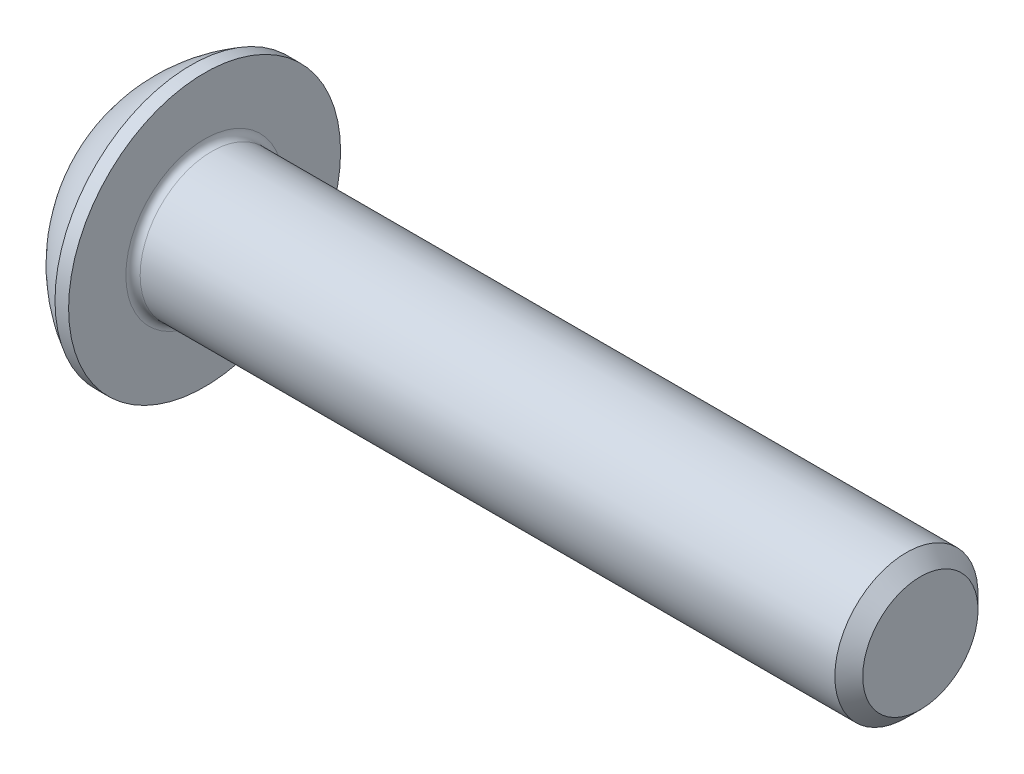
ISO-10303-21;
HEADER;
FILE_DESCRIPTION(('STEP AP214'),'2;1');
FILE_NAME('part.step','',(''),(''),'','','');
FILE_SCHEMA(('AUTOMOTIVE_DESIGN { 1 0 10303 214 1 1 1 1 }'));
ENDSEC;
DATA;
#1=APPLICATION_CONTEXT('core data for automotive mechanical design processes');
#2=APPLICATION_PROTOCOL_DEFINITION('international standard','automotive_design',2000,#1);
#3=PRODUCT_CONTEXT('',#1,'mechanical');
#4=PRODUCT('Part','Part','',(#3));
#5=PRODUCT_RELATED_PRODUCT_CATEGORY('part','',(#4));
#6=PRODUCT_DEFINITION_FORMATION('','',#4);
#7=PRODUCT_DEFINITION_CONTEXT('part definition',#1,'design');
#8=PRODUCT_DEFINITION('design','',#6,#7);
#9=PRODUCT_DEFINITION_SHAPE('','',#8);
#10=(LENGTH_UNIT() NAMED_UNIT(*) SI_UNIT(.MILLI.,.METRE.));
#11=(NAMED_UNIT(*) PLANE_ANGLE_UNIT() SI_UNIT($,.RADIAN.));
#12=(NAMED_UNIT(*) SI_UNIT($,.STERADIAN.) SOLID_ANGLE_UNIT());
#13=UNCERTAINTY_MEASURE_WITH_UNIT(LENGTH_MEASURE(1.E-05),#10,'distance_accuracy_value','');
#14=(GEOMETRIC_REPRESENTATION_CONTEXT(3) GLOBAL_UNCERTAINTY_ASSIGNED_CONTEXT((#13)) GLOBAL_UNIT_ASSIGNED_CONTEXT((#10,
#11,#12)) REPRESENTATION_CONTEXT('',''));
#15=CARTESIAN_POINT('',(0.,0.,0.));
#16=DIRECTION('',(0.,0.,1.));
#17=DIRECTION('',(1.,0.,0.));
#18=AXIS2_PLACEMENT_3D('',#15,#16,#17);
#19=CARTESIAN_POINT('',(0.,0.,0.));
#20=DIRECTION('',(-1.,0.,0.));
#21=DIRECTION('',(0.,0.,1.));
#22=AXIS2_PLACEMENT_3D('',#19,#20,#21);
#23=PLANE('',#22);
#24=CARTESIAN_POINT('',(0.,0.,0.));
#25=DIRECTION('',(-1.,0.,0.));
#26=DIRECTION('',(0.,0.,1.));
#27=AXIS2_PLACEMENT_3D('',#24,#25,#26);
#28=CIRCLE('',#27,1.9);
#29=CARTESIAN_POINT('',(0.,0.,1.9));
#30=VERTEX_POINT('',#29);
#31=EDGE_CURVE('E152',#30,#30,#28,.T.);
#32=ORIENTED_EDGE('',*,*,#31,.T.);
#33=EDGE_LOOP('',(#32));
#34=FACE_BOUND('',#33,.T.);
#35=DIRECTION('',(0.,-1.,0.));
#36=VECTOR('',#35,1.);
#37=CARTESIAN_POINT('',(0.,-0.721687836487032,1.25));
#38=LINE('',#37,#36);
#39=CARTESIAN_POINT('',(0.,0.721687836487034,1.25));
#40=VERTEX_POINT('',#39);
#41=CARTESIAN_POINT('',(0.,-0.721687836487032,1.25));
#42=VERTEX_POINT('',#41);
#43=EDGE_CURVE('E47',#40,#42,#38,.T.);
#44=ORIENTED_EDGE('',*,*,#43,.T.);
#45=DIRECTION('',(0.,-0.499999999999999,-0.866025403784439));
#46=VECTOR('',#45,1.);
#47=CARTESIAN_POINT('',(0.,-1.44337567297406,0.));
#48=LINE('',#47,#46);
#49=CARTESIAN_POINT('',(0.,-1.44337567297406,0.));
#50=VERTEX_POINT('',#49);
#51=EDGE_CURVE('E272',#42,#50,#48,.T.);
#52=ORIENTED_EDGE('',*,*,#51,.T.);
#53=DIRECTION('',(0.,0.499999999999999,-0.866025403784439));
#54=VECTOR('',#53,1.);
#55=CARTESIAN_POINT('',(0.,-0.721687836487033,-1.25));
#56=LINE('',#55,#54);
#57=CARTESIAN_POINT('',(0.,-0.721687836487033,-1.25));
#58=VERTEX_POINT('',#57);
#59=EDGE_CURVE('E127',#50,#58,#56,.T.);
#60=ORIENTED_EDGE('',*,*,#59,.T.);
#61=DIRECTION('',(0.,1.,0.));
#62=VECTOR('',#61,1.);
#63=CARTESIAN_POINT('',(0.,0.721687836487034,-1.25));
#64=LINE('',#63,#62);
#65=CARTESIAN_POINT('',(0.,0.721687836487034,-1.25));
#66=VERTEX_POINT('',#65);
#67=EDGE_CURVE('E275',#58,#66,#64,.T.);
#68=ORIENTED_EDGE('',*,*,#67,.T.);
#69=DIRECTION('',(0.,0.5,0.866025403784439));
#70=VECTOR('',#69,1.);
#71=CARTESIAN_POINT('',(0.,1.44337567297407,0.));
#72=LINE('',#71,#70);
#73=CARTESIAN_POINT('',(0.,1.44337567297407,0.));
#74=VERTEX_POINT('',#73);
#75=EDGE_CURVE('E277',#66,#74,#72,.T.);
#76=ORIENTED_EDGE('',*,*,#75,.T.);
#77=DIRECTION('',(0.,-0.499999999999999,0.866025403784439));
#78=VECTOR('',#77,1.);
#79=CARTESIAN_POINT('',(0.,0.721687836487034,1.25));
#80=LINE('',#79,#78);
#81=EDGE_CURVE('E279',#74,#40,#80,.T.);
#82=ORIENTED_EDGE('',*,*,#81,.T.);
#83=EDGE_LOOP('',(#44,#52,#60,#68,#76,#82));
#84=FACE_BOUND('',#83,.T.);
#85=ADVANCED_FACE('F32',(#34,#84),#23,.T.);
#86=CARTESIAN_POINT('',(3.88527472527473,0.,0.));
#87=DIRECTION('',(-1.,0.,0.));
#88=DIRECTION('',(0.,1.,0.));
#89=AXIS2_PLACEMENT_3D('',#86,#87,#88);
#90=SPHERICAL_SURFACE('',#89,4.32496932831421);
#91=CARTESIAN_POINT('',(1.82,0.,0.));
#92=DIRECTION('',(-1.,0.,0.));
#93=DIRECTION('',(0.,0.,1.));
#94=AXIS2_PLACEMENT_3D('',#91,#92,#93);
#95=CIRCLE('',#94,3.8);
#96=CARTESIAN_POINT('',(1.82,0.,3.8));
#97=VERTEX_POINT('',#96);
#98=EDGE_CURVE('E149',#97,#97,#95,.T.);
#99=ORIENTED_EDGE('',*,*,#98,.T.);
#100=EDGE_LOOP('',(#99));
#101=FACE_BOUND('',#100,.T.);
#102=ORIENTED_EDGE('',*,*,#31,.F.);
#103=EDGE_LOOP('',(#102));
#104=FACE_BOUND('',#103,.T.);
#105=ADVANCED_FACE('F173',(#101,#104),#90,.T.);
#106=CARTESIAN_POINT('',(0.,0.,0.));
#107=DIRECTION('',(-1.,0.,0.));
#108=DIRECTION('',(0.,0.,1.));
#109=AXIS2_PLACEMENT_3D('',#106,#107,#108);
#110=CYLINDRICAL_SURFACE('',#109,3.8);
#111=ORIENTED_EDGE('',*,*,#98,.F.);
#112=EDGE_LOOP('',(#111));
#113=FACE_BOUND('',#112,.T.);
#114=CARTESIAN_POINT('',(2.2,0.,0.));
#115=DIRECTION('',(-1.,0.,0.));
#116=DIRECTION('',(0.,0.,1.));
#117=AXIS2_PLACEMENT_3D('',#114,#115,#116);
#118=CIRCLE('',#117,3.8);
#119=CARTESIAN_POINT('',(2.2,0.,3.8));
#120=VERTEX_POINT('',#119);
#121=EDGE_CURVE('E146',#120,#120,#118,.T.);
#122=ORIENTED_EDGE('',*,*,#121,.T.);
#123=EDGE_LOOP('',(#122));
#124=FACE_BOUND('',#123,.T.);
#125=ADVANCED_FACE('F178',(#113,#124),#110,.T.);
#126=CARTESIAN_POINT('',(2.2,1.99999999999999,0.));
#127=DIRECTION('',(-1.,0.,0.));
#128=DIRECTION('',(0.,0.,1.));
#129=AXIS2_PLACEMENT_3D('',#126,#127,#128);
#130=PLANE('',#129);
#131=CARTESIAN_POINT('',(2.2,0.,0.));
#132=DIRECTION('',(-1.,0.,0.));
#133=DIRECTION('',(0.,0.,1.));
#134=AXIS2_PLACEMENT_3D('',#131,#132,#133);
#135=CIRCLE('',#134,2.2);
#136=CARTESIAN_POINT('',(2.2,0.,2.2));
#137=VERTEX_POINT('',#136);
#138=EDGE_CURVE('E40',#137,#137,#135,.T.);
#139=ORIENTED_EDGE('',*,*,#138,.T.);
#140=EDGE_LOOP('',(#139));
#141=FACE_BOUND('',#140,.T.);
#142=ORIENTED_EDGE('',*,*,#121,.F.);
#143=EDGE_LOOP('',(#142));
#144=FACE_BOUND('',#143,.T.);
#145=ADVANCED_FACE('F157',(#141,#144),#130,.F.);
#146=CARTESIAN_POINT('',(0.,0.,0.));
#147=DIRECTION('',(-1.,0.,0.));
#148=DIRECTION('',(0.,0.,1.));
#149=AXIS2_PLACEMENT_3D('',#146,#147,#148);
#150=CYLINDRICAL_SURFACE('',#149,2.);
#151=CARTESIAN_POINT('',(2.4,0.,0.));
#152=DIRECTION('',(-1.,0.,0.));
#153=DIRECTION('',(0.,0.,1.));
#154=AXIS2_PLACEMENT_3D('',#151,#152,#153);
#155=CIRCLE('',#154,2.);
#156=CARTESIAN_POINT('',(2.4,0.,2.));
#157=VERTEX_POINT('',#156);
#158=EDGE_CURVE('E11',#157,#157,#155,.F.);
#159=ORIENTED_EDGE('',*,*,#158,.T.);
#160=EDGE_LOOP('',(#159));
#161=FACE_BOUND('',#160,.T.);
#162=CARTESIAN_POINT('',(21.81,0.,0.));
#163=DIRECTION('',(-1.,0.,0.));
#164=DIRECTION('',(0.,0.,1.));
#165=AXIS2_PLACEMENT_3D('',#162,#163,#164);
#166=CIRCLE('',#165,2.);
#167=CARTESIAN_POINT('',(21.81,0.,2.));
#168=VERTEX_POINT('',#167);
#169=EDGE_CURVE('E143',#168,#168,#166,.T.);
#170=ORIENTED_EDGE('',*,*,#169,.T.);
#171=EDGE_LOOP('',(#170));
#172=FACE_BOUND('',#171,.T.);
#173=ADVANCED_FACE('F187',(#161,#172),#150,.T.);
#174=CARTESIAN_POINT('',(22.2,0.,0.));
#175=DIRECTION('',(-1.,0.,0.));
#176=DIRECTION('',(0.,0.,1.));
#177=AXIS2_PLACEMENT_3D('',#174,#175,#176);
#178=CONICAL_SURFACE('',#177,1.61,0.785398163397443);
#179=ORIENTED_EDGE('',*,*,#169,.F.);
#180=EDGE_LOOP('',(#179));
#181=FACE_BOUND('',#180,.T.);
#182=CARTESIAN_POINT('',(22.2,0.,0.));
#183=DIRECTION('',(-1.,0.,0.));
#184=DIRECTION('',(0.,0.,1.));
#185=AXIS2_PLACEMENT_3D('',#182,#183,#184);
#186=CIRCLE('',#185,1.61);
#187=CARTESIAN_POINT('',(22.2,0.,1.61));
#188=VERTEX_POINT('',#187);
#189=EDGE_CURVE('E139',#188,#188,#186,.T.);
#190=ORIENTED_EDGE('',*,*,#189,.T.);
#191=EDGE_LOOP('',(#190));
#192=FACE_BOUND('',#191,.T.);
#193=ADVANCED_FACE('F168',(#181,#192),#178,.T.);
#194=CARTESIAN_POINT('',(22.2,0.,0.));
#195=DIRECTION('',(-1.,0.,0.));
#196=DIRECTION('',(0.,0.,1.));
#197=AXIS2_PLACEMENT_3D('',#194,#195,#196);
#198=PLANE('',#197);
#199=ORIENTED_EDGE('',*,*,#189,.F.);
#200=EDGE_LOOP('',(#199));
#201=FACE_BOUND('',#200,.T.);
#202=ADVANCED_FACE('F161',(#201),#198,.F.);
#203=CARTESIAN_POINT('',(2.4,0.,0.));
#204=DIRECTION('',(-1.,0.,0.));
#205=DIRECTION('',(0.,0.,1.));
#206=AXIS2_PLACEMENT_3D('',#203,#204,#205);
#207=TOROIDAL_SURFACE('',#206,2.2,0.2);
#208=ORIENTED_EDGE('',*,*,#158,.F.);
#209=EDGE_LOOP('',(#208));
#210=FACE_BOUND('',#209,.T.);
#211=ORIENTED_EDGE('',*,*,#138,.F.);
#212=EDGE_LOOP('',(#211));
#213=FACE_BOUND('',#212,.T.);
#214=ADVANCED_FACE('F34',(#210,#213),#207,.F.);
#215=CARTESIAN_POINT('',(1.3,-1.44337567297406,0.));
#216=DIRECTION('',(0.,0.866025403784439,-0.499999999999999));
#217=DIRECTION('',(0.,0.499999999999999,0.866025403784439));
#218=AXIS2_PLACEMENT_3D('',#215,#216,#217);
#219=PLANE('',#218);
#220=DIRECTION('',(0.,-0.499999999999999,-0.866025403784439));
#221=VECTOR('',#220,1.);
#222=CARTESIAN_POINT('',(1.3,-1.44337567297406,0.));
#223=LINE('',#222,#221);
#224=CARTESIAN_POINT('',(1.3,-0.721687836487032,1.25));
#225=VERTEX_POINT('',#224);
#226=CARTESIAN_POINT('',(1.3,-1.08253175473055,0.624999999999999));
#227=VERTEX_POINT('',#226);
#228=EDGE_CURVE('E113',#225,#227,#223,.T.);
#229=ORIENTED_EDGE('',*,*,#228,.T.);
#230=CARTESIAN_POINT('',(1.3,-1.44337567297406,0.));
#231=VERTEX_POINT('',#230);
#232=EDGE_CURVE('E108',#227,#231,#223,.T.);
#233=ORIENTED_EDGE('',*,*,#232,.T.);
#234=DIRECTION('',(-1.,0.,0.));
#235=VECTOR('',#234,1.);
#236=CARTESIAN_POINT('',(1.3,-1.44337567297406,0.));
#237=LINE('',#236,#235);
#238=EDGE_CURVE('E110',#231,#50,#237,.T.);
#239=ORIENTED_EDGE('',*,*,#238,.T.);
#240=ORIENTED_EDGE('',*,*,#51,.F.);
#241=DIRECTION('',(-1.,0.,0.));
#242=VECTOR('',#241,1.);
#243=CARTESIAN_POINT('',(1.3,-0.721687836487032,1.25));
#244=LINE('',#243,#242);
#245=EDGE_CURVE('E268',#225,#42,#244,.T.);
#246=ORIENTED_EDGE('',*,*,#245,.F.);
#247=EDGE_LOOP('',(#229,#233,#239,#240,#246));
#248=FACE_BOUND('',#247,.T.);
#249=ADVANCED_FACE('F109',(#248),#219,.T.);
#250=CARTESIAN_POINT('',(1.3,-0.721687836487033,-1.25));
#251=DIRECTION('',(0.,0.866025403784439,0.499999999999999));
#252=DIRECTION('',(0.,-0.499999999999999,0.866025403784439));
#253=AXIS2_PLACEMENT_3D('',#250,#251,#252);
#254=PLANE('',#253);
#255=DIRECTION('',(0.,0.499999999999999,-0.866025403784439));
#256=VECTOR('',#255,1.);
#257=CARTESIAN_POINT('',(1.3,-0.721687836487033,-1.25));
#258=LINE('',#257,#256);
#259=CARTESIAN_POINT('',(1.3,-1.08253175473055,-0.624999999999999));
#260=VERTEX_POINT('',#259);
#261=EDGE_CURVE('E55',#231,#260,#258,.T.);
#262=ORIENTED_EDGE('',*,*,#261,.T.);
#263=CARTESIAN_POINT('',(1.3,-0.721687836487033,-1.25));
#264=VERTEX_POINT('',#263);
#265=EDGE_CURVE('E122',#260,#264,#258,.T.);
#266=ORIENTED_EDGE('',*,*,#265,.T.);
#267=DIRECTION('',(-1.,0.,0.));
#268=VECTOR('',#267,1.);
#269=CARTESIAN_POINT('',(1.3,-0.721687836487033,-1.25));
#270=LINE('',#269,#268);
#271=EDGE_CURVE('E129',#264,#58,#270,.T.);
#272=ORIENTED_EDGE('',*,*,#271,.T.);
#273=ORIENTED_EDGE('',*,*,#59,.F.);
#274=ORIENTED_EDGE('',*,*,#238,.F.);
#275=EDGE_LOOP('',(#262,#266,#272,#273,#274));
#276=FACE_BOUND('',#275,.T.);
#277=ADVANCED_FACE('F125',(#276),#254,.T.);
#278=CARTESIAN_POINT('',(1.3,0.721687836487034,-1.25));
#279=DIRECTION('',(0.,0.,1.));
#280=DIRECTION('',(1.,0.,0.));
#281=AXIS2_PLACEMENT_3D('',#278,#279,#280);
#282=PLANE('',#281);
#283=DIRECTION('',(0.,1.,0.));
#284=VECTOR('',#283,1.);
#285=CARTESIAN_POINT('',(1.3,0.721687836487034,-1.25));
#286=LINE('',#285,#284);
#287=CARTESIAN_POINT('',(1.3,0.,-1.25));
#288=VERTEX_POINT('',#287);
#289=EDGE_CURVE('E249',#264,#288,#286,.T.);
#290=ORIENTED_EDGE('',*,*,#289,.T.);
#291=CARTESIAN_POINT('',(1.3,0.721687836487034,-1.25));
#292=VERTEX_POINT('',#291);
#293=EDGE_CURVE('E121',#288,#292,#286,.T.);
#294=ORIENTED_EDGE('',*,*,#293,.T.);
#295=DIRECTION('',(-1.,0.,0.));
#296=VECTOR('',#295,1.);
#297=CARTESIAN_POINT('',(1.3,0.721687836487034,-1.25));
#298=LINE('',#297,#296);
#299=EDGE_CURVE('E134',#292,#66,#298,.T.);
#300=ORIENTED_EDGE('',*,*,#299,.T.);
#301=ORIENTED_EDGE('',*,*,#67,.F.);
#302=ORIENTED_EDGE('',*,*,#271,.F.);
#303=EDGE_LOOP('',(#290,#294,#300,#301,#302));
#304=FACE_BOUND('',#303,.T.);
#305=ADVANCED_FACE('F201',(#304),#282,.T.);
#306=CARTESIAN_POINT('',(1.3,1.44337567297407,0.));
#307=DIRECTION('',(0.,-0.866025403784439,0.5));
#308=DIRECTION('',(0.,-0.5,-0.866025403784439));
#309=AXIS2_PLACEMENT_3D('',#306,#307,#308);
#310=PLANE('',#309);
#311=DIRECTION('',(0.,0.5,0.866025403784439));
#312=VECTOR('',#311,1.);
#313=CARTESIAN_POINT('',(1.3,1.44337567297407,0.));
#314=LINE('',#313,#312);
#315=CARTESIAN_POINT('',(1.3,1.08253175473055,-0.625));
#316=VERTEX_POINT('',#315);
#317=EDGE_CURVE('E238',#292,#316,#314,.T.);
#318=ORIENTED_EDGE('',*,*,#317,.T.);
#319=CARTESIAN_POINT('',(1.3,1.44337567297407,0.));
#320=VERTEX_POINT('',#319);
#321=EDGE_CURVE('E243',#316,#320,#314,.T.);
#322=ORIENTED_EDGE('',*,*,#321,.T.);
#323=DIRECTION('',(-1.,0.,0.));
#324=VECTOR('',#323,1.);
#325=CARTESIAN_POINT('',(1.3,1.44337567297407,0.));
#326=LINE('',#325,#324);
#327=EDGE_CURVE('E283',#320,#74,#326,.T.);
#328=ORIENTED_EDGE('',*,*,#327,.T.);
#329=ORIENTED_EDGE('',*,*,#75,.F.);
#330=ORIENTED_EDGE('',*,*,#299,.F.);
#331=EDGE_LOOP('',(#318,#322,#328,#329,#330));
#332=FACE_BOUND('',#331,.T.);
#333=ADVANCED_FACE('F204',(#332),#310,.T.);
#334=CARTESIAN_POINT('',(1.3,0.721687836487034,1.25));
#335=DIRECTION('',(0.,-0.866025403784439,-0.499999999999999));
#336=DIRECTION('',(0.,0.499999999999999,-0.866025403784439));
#337=AXIS2_PLACEMENT_3D('',#334,#335,#336);
#338=PLANE('',#337);
#339=DIRECTION('',(0.,-0.499999999999999,0.866025403784439));
#340=VECTOR('',#339,1.);
#341=CARTESIAN_POINT('',(1.3,0.721687836487034,1.25));
#342=LINE('',#341,#340);
#343=CARTESIAN_POINT('',(1.3,1.08253175473055,0.625));
#344=VERTEX_POINT('',#343);
#345=EDGE_CURVE('E246',#320,#344,#342,.T.);
#346=ORIENTED_EDGE('',*,*,#345,.T.);
#347=CARTESIAN_POINT('',(1.3,0.721687836487034,1.25));
#348=VERTEX_POINT('',#347);
#349=EDGE_CURVE('E254',#344,#348,#342,.T.);
#350=ORIENTED_EDGE('',*,*,#349,.T.);
#351=DIRECTION('',(-1.,0.,0.));
#352=VECTOR('',#351,1.);
#353=CARTESIAN_POINT('',(1.3,0.721687836487034,1.25));
#354=LINE('',#353,#352);
#355=EDGE_CURVE('E267',#348,#40,#354,.T.);
#356=ORIENTED_EDGE('',*,*,#355,.T.);
#357=ORIENTED_EDGE('',*,*,#81,.F.);
#358=ORIENTED_EDGE('',*,*,#327,.F.);
#359=EDGE_LOOP('',(#346,#350,#356,#357,#358));
#360=FACE_BOUND('',#359,.T.);
#361=ADVANCED_FACE('F208',(#360),#338,.T.);
#362=CARTESIAN_POINT('',(1.3,-0.721687836487032,1.25));
#363=DIRECTION('',(0.,0.,-1.));
#364=DIRECTION('',(0.,1.,0.));
#365=AXIS2_PLACEMENT_3D('',#362,#363,#364);
#366=PLANE('',#365);
#367=DIRECTION('',(0.,-1.,0.));
#368=VECTOR('',#367,1.);
#369=CARTESIAN_POINT('',(1.3,-0.721687836487032,1.25));
#370=LINE('',#369,#368);
#371=CARTESIAN_POINT('',(1.3,0.,1.25));
#372=VERTEX_POINT('',#371);
#373=EDGE_CURVE('E260',#348,#372,#370,.T.);
#374=ORIENTED_EDGE('',*,*,#373,.T.);
#375=EDGE_CURVE('E262',#372,#225,#370,.T.);
#376=ORIENTED_EDGE('',*,*,#375,.T.);
#377=ORIENTED_EDGE('',*,*,#245,.T.);
#378=ORIENTED_EDGE('',*,*,#43,.F.);
#379=ORIENTED_EDGE('',*,*,#355,.F.);
#380=EDGE_LOOP('',(#374,#376,#377,#378,#379));
#381=FACE_BOUND('',#380,.T.);
#382=ADVANCED_FACE('F212',(#381),#366,.T.);
#383=CARTESIAN_POINT('',(1.3,-2.16506350946109,-1.25));
#384=DIRECTION('',(1.,0.,0.));
#385=DIRECTION('',(0.,0.,-1.));
#386=AXIS2_PLACEMENT_3D('',#383,#384,#385);
#387=PLANE('',#386);
#388=CARTESIAN_POINT('',(1.3,0.,0.));
#389=DIRECTION('',(-1.,0.,0.));
#390=DIRECTION('',(0.,0.,1.));
#391=AXIS2_PLACEMENT_3D('',#388,#389,#390);
#392=CIRCLE('',#391,1.25);
#393=EDGE_CURVE('E235',#316,#288,#392,.T.);
#394=ORIENTED_EDGE('',*,*,#393,.F.);
#395=ORIENTED_EDGE('',*,*,#317,.F.);
#396=ORIENTED_EDGE('',*,*,#293,.F.);
#397=EDGE_LOOP('',(#394,#395,#396));
#398=FACE_BOUND('',#397,.T.);
#399=ADVANCED_FACE('F216',(#398),#387,.F.);
#400=EDGE_CURVE('E140',#344,#316,#392,.T.);
#401=ORIENTED_EDGE('',*,*,#400,.F.);
#402=ORIENTED_EDGE('',*,*,#345,.F.);
#403=ORIENTED_EDGE('',*,*,#321,.F.);
#404=EDGE_LOOP('',(#401,#402,#403));
#405=FACE_BOUND('',#404,.T.);
#406=ADVANCED_FACE('F225',(#405),#387,.F.);
#407=EDGE_CURVE('E133',#372,#344,#392,.T.);
#408=ORIENTED_EDGE('',*,*,#407,.F.);
#409=ORIENTED_EDGE('',*,*,#373,.F.);
#410=ORIENTED_EDGE('',*,*,#349,.F.);
#411=EDGE_LOOP('',(#408,#409,#410));
#412=FACE_BOUND('',#411,.T.);
#413=ADVANCED_FACE('F230',(#412),#387,.F.);
#414=EDGE_CURVE('E128',#227,#372,#392,.T.);
#415=ORIENTED_EDGE('',*,*,#414,.F.);
#416=ORIENTED_EDGE('',*,*,#228,.F.);
#417=ORIENTED_EDGE('',*,*,#375,.F.);
#418=EDGE_LOOP('',(#415,#416,#417));
#419=FACE_BOUND('',#418,.T.);
#420=ADVANCED_FACE('F223',(#419),#387,.F.);
#421=EDGE_CURVE('E119',#260,#227,#392,.T.);
#422=ORIENTED_EDGE('',*,*,#421,.F.);
#423=ORIENTED_EDGE('',*,*,#261,.F.);
#424=ORIENTED_EDGE('',*,*,#232,.F.);
#425=EDGE_LOOP('',(#422,#423,#424));
#426=FACE_BOUND('',#425,.T.);
#427=ADVANCED_FACE('F118',(#426),#387,.F.);
#428=EDGE_CURVE('E241',#288,#260,#392,.T.);
#429=ORIENTED_EDGE('',*,*,#428,.F.);
#430=ORIENTED_EDGE('',*,*,#289,.F.);
#431=ORIENTED_EDGE('',*,*,#265,.F.);
#432=EDGE_LOOP('',(#429,#430,#431));
#433=FACE_BOUND('',#432,.T.);
#434=ADVANCED_FACE('F196',(#433),#387,.F.);
#435=CARTESIAN_POINT('',(2.02168783648704,0.,0.));
#436=DIRECTION('',(-1.,0.,0.));
#437=DIRECTION('',(0.,0.,1.));
#438=AXIS2_PLACEMENT_3D('',#435,#436,#437);
#439=CONICAL_SURFACE('',#438,0.,1.04719755119659);
#440=ORIENTED_EDGE('',*,*,#407,.T.);
#441=ORIENTED_EDGE('',*,*,#400,.T.);
#442=ORIENTED_EDGE('',*,*,#393,.T.);
#443=ORIENTED_EDGE('',*,*,#428,.T.);
#444=ORIENTED_EDGE('',*,*,#421,.T.);
#445=ORIENTED_EDGE('',*,*,#414,.T.);
#446=EDGE_LOOP('',(#440,#441,#442,#443,#444,#445));
#447=FACE_BOUND('',#446,.T.);
#448=CARTESIAN_POINT('',(2.02168783648704,0.,0.));
#449=VERTEX_POINT('',#448);
#450=VERTEX_LOOP('',#449);
#451=FACE_BOUND('',#450,.T.);
#452=ADVANCED_FACE('F194',(#447,#451),#439,.F.);
#453=CLOSED_SHELL('',(#85,#105,#125,#145,#173,#193,#202,#214,#249,#277,#305,#333,#361,#382,#399,
#406,#413,#420,#427,#434,#452));
#454=MANIFOLD_SOLID_BREP('B2',#453);
#455=ADVANCED_BREP_SHAPE_REPRESENTATION('',(#18,#454),#14);
#456=SHAPE_DEFINITION_REPRESENTATION(#9,#455);
ENDSEC;
END-ISO-10303-21;
